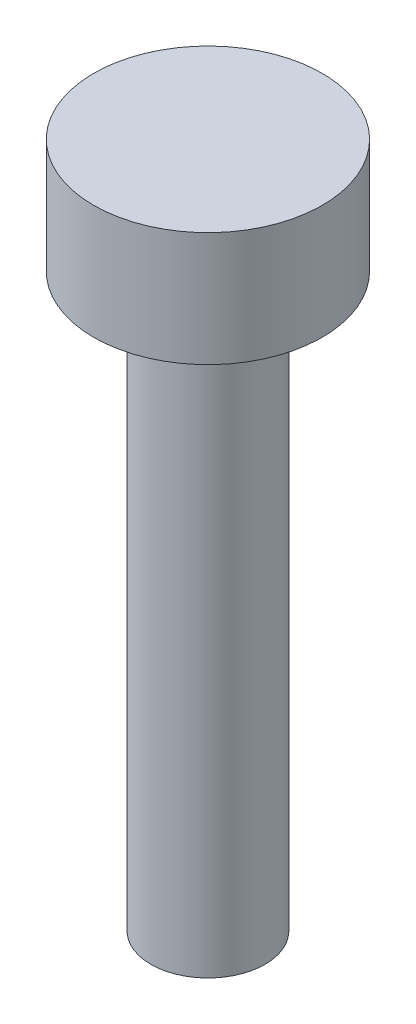
ISO-10303-21;
HEADER;
FILE_DESCRIPTION(('STEP AP214'),'2;1');
FILE_NAME('part.step','',(''),(''),'','','');
FILE_SCHEMA(('AUTOMOTIVE_DESIGN { 1 0 10303 214 1 1 1 1 }'));
ENDSEC;
DATA;
#1=APPLICATION_CONTEXT('core data for automotive mechanical design processes');
#2=APPLICATION_PROTOCOL_DEFINITION('international standard','automotive_design',2000,#1);
#3=PRODUCT_CONTEXT('',#1,'mechanical');
#4=PRODUCT('Part','Part','',(#3));
#5=PRODUCT_RELATED_PRODUCT_CATEGORY('part','',(#4));
#6=PRODUCT_DEFINITION_FORMATION('','',#4);
#7=PRODUCT_DEFINITION_CONTEXT('part definition',#1,'design');
#8=PRODUCT_DEFINITION('design','',#6,#7);
#9=PRODUCT_DEFINITION_SHAPE('','',#8);
#10=(LENGTH_UNIT() NAMED_UNIT(*) SI_UNIT(.MILLI.,.METRE.));
#11=(NAMED_UNIT(*) PLANE_ANGLE_UNIT() SI_UNIT($,.RADIAN.));
#12=(NAMED_UNIT(*) SI_UNIT($,.STERADIAN.) SOLID_ANGLE_UNIT());
#13=UNCERTAINTY_MEASURE_WITH_UNIT(LENGTH_MEASURE(1.E-05),#10,'distance_accuracy_value','');
#14=(GEOMETRIC_REPRESENTATION_CONTEXT(3) GLOBAL_UNCERTAINTY_ASSIGNED_CONTEXT((#13)) GLOBAL_UNIT_ASSIGNED_CONTEXT((#10,
#11,#12)) REPRESENTATION_CONTEXT('',''));
#15=CARTESIAN_POINT('',(0.,0.,0.));
#16=DIRECTION('',(0.,0.,1.));
#17=DIRECTION('',(1.,0.,0.));
#18=AXIS2_PLACEMENT_3D('',#15,#16,#17);
#19=CARTESIAN_POINT('',(0.,12.7,0.));
#20=DIRECTION('',(0.,-1.,0.));
#21=DIRECTION('',(0.,0.,-1.));
#22=AXIS2_PLACEMENT_3D('',#19,#20,#21);
#23=CYLINDRICAL_SURFACE('',#22,1.27);
#24=CARTESIAN_POINT('',(0.,12.7,0.));
#25=DIRECTION('',(0.,1.,0.));
#26=DIRECTION('',(0.,0.,1.));
#27=AXIS2_PLACEMENT_3D('',#24,#25,#26);
#28=CIRCLE('',#27,1.27);
#29=CARTESIAN_POINT('',(0.,12.7,1.27));
#30=VERTEX_POINT('',#29);
#31=EDGE_CURVE('E10',#30,#30,#28,.T.);
#32=ORIENTED_EDGE('',*,*,#31,.F.);
#33=EDGE_LOOP('',(#32));
#34=FACE_BOUND('',#33,.T.);
#35=CARTESIAN_POINT('',(0.,0.,0.));
#36=DIRECTION('',(0.,1.,0.));
#37=DIRECTION('',(0.,0.,1.));
#38=AXIS2_PLACEMENT_3D('',#35,#36,#37);
#39=CIRCLE('',#38,1.27);
#40=CARTESIAN_POINT('',(0.,0.,1.27));
#41=VERTEX_POINT('',#40);
#42=EDGE_CURVE('E34',#41,#41,#39,.T.);
#43=ORIENTED_EDGE('',*,*,#42,.T.);
#44=EDGE_LOOP('',(#43));
#45=FACE_BOUND('',#44,.T.);
#46=ADVANCED_FACE('F31',(#34,#45),#23,.T.);
#47=CARTESIAN_POINT('',(0.,0.,0.));
#48=DIRECTION('',(0.,1.,0.));
#49=DIRECTION('',(0.,0.,1.));
#50=AXIS2_PLACEMENT_3D('',#47,#48,#49);
#51=PLANE('',#50);
#52=ORIENTED_EDGE('',*,*,#42,.F.);
#53=EDGE_LOOP('',(#52));
#54=FACE_BOUND('',#53,.T.);
#55=ADVANCED_FACE('F54',(#54),#51,.F.);
#56=CARTESIAN_POINT('',(0.,15.24,0.));
#57=DIRECTION('',(0.,-1.,0.));
#58=DIRECTION('',(0.,0.,-1.));
#59=AXIS2_PLACEMENT_3D('',#56,#57,#58);
#60=CYLINDRICAL_SURFACE('',#59,2.54);
#61=CARTESIAN_POINT('',(0.,15.24,0.));
#62=DIRECTION('',(0.,1.,0.));
#63=DIRECTION('',(0.,0.,1.));
#64=AXIS2_PLACEMENT_3D('',#61,#62,#63);
#65=CIRCLE('',#64,2.54);
#66=CARTESIAN_POINT('',(0.,15.24,2.54));
#67=VERTEX_POINT('',#66);
#68=EDGE_CURVE('E41',#67,#67,#65,.T.);
#69=ORIENTED_EDGE('',*,*,#68,.F.);
#70=EDGE_LOOP('',(#69));
#71=FACE_BOUND('',#70,.T.);
#72=CARTESIAN_POINT('',(0.,12.7,0.));
#73=DIRECTION('',(0.,1.,0.));
#74=DIRECTION('',(0.,0.,1.));
#75=AXIS2_PLACEMENT_3D('',#72,#73,#74);
#76=CIRCLE('',#75,2.54);
#77=CARTESIAN_POINT('',(0.,12.7,2.54));
#78=VERTEX_POINT('',#77);
#79=EDGE_CURVE('E43',#78,#78,#76,.T.);
#80=ORIENTED_EDGE('',*,*,#79,.T.);
#81=EDGE_LOOP('',(#80));
#82=FACE_BOUND('',#81,.T.);
#83=ADVANCED_FACE('F51',(#71,#82),#60,.T.);
#84=CARTESIAN_POINT('',(0.,15.24,0.));
#85=DIRECTION('',(0.,1.,0.));
#86=DIRECTION('',(0.,0.,1.));
#87=AXIS2_PLACEMENT_3D('',#84,#85,#86);
#88=PLANE('',#87);
#89=ORIENTED_EDGE('',*,*,#68,.T.);
#90=EDGE_LOOP('',(#89));
#91=FACE_BOUND('',#90,.T.);
#92=ADVANCED_FACE('F49',(#91),#88,.T.);
#93=CARTESIAN_POINT('',(0.,12.7,0.));
#94=DIRECTION('',(0.,1.,0.));
#95=DIRECTION('',(0.,0.,1.));
#96=AXIS2_PLACEMENT_3D('',#93,#94,#95);
#97=PLANE('',#96);
#98=ORIENTED_EDGE('',*,*,#31,.T.);
#99=EDGE_LOOP('',(#98));
#100=FACE_BOUND('',#99,.T.);
#101=ORIENTED_EDGE('',*,*,#79,.F.);
#102=EDGE_LOOP('',(#101));
#103=FACE_BOUND('',#102,.T.);
#104=ADVANCED_FACE('F58',(#100,#103),#97,.F.);
#105=CLOSED_SHELL('',(#46,#55,#83,#92,#104));
#106=MANIFOLD_SOLID_BREP('B2',#105);
#107=ADVANCED_BREP_SHAPE_REPRESENTATION('',(#18,#106),#14);
#108=SHAPE_DEFINITION_REPRESENTATION(#9,#107);
ENDSEC;
END-ISO-10303-21;
